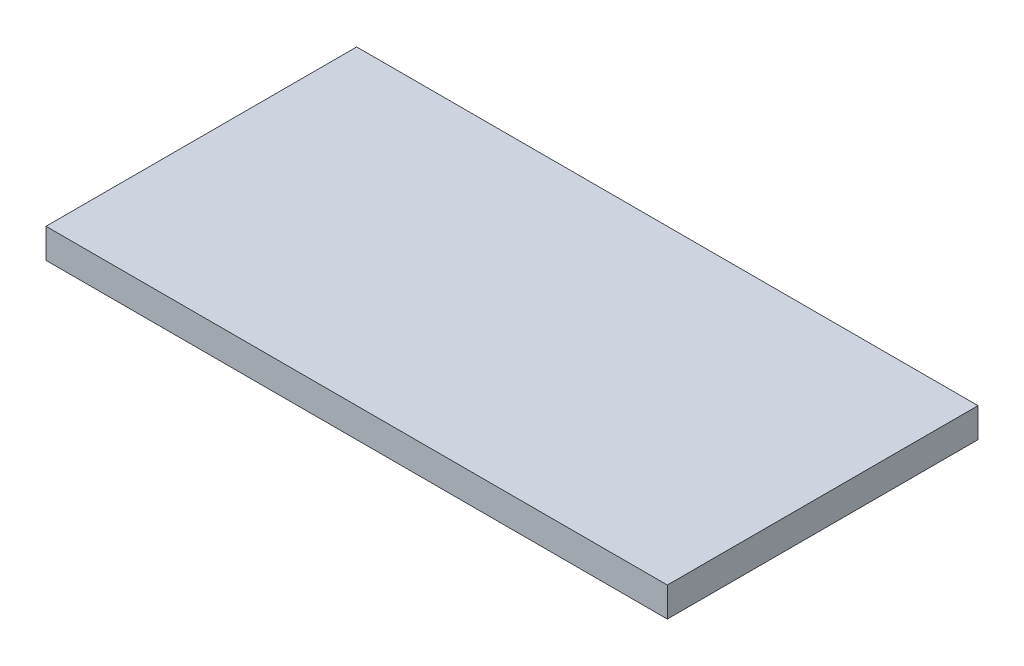
ISO-10303-21;
HEADER;
FILE_DESCRIPTION(('STEP AP214'),'2;1');
FILE_NAME('part.step','',(''),(''),'','','');
FILE_SCHEMA(('AUTOMOTIVE_DESIGN { 1 0 10303 214 1 1 1 1 }'));
ENDSEC;
DATA;
#1=APPLICATION_CONTEXT('core data for automotive mechanical design processes');
#2=APPLICATION_PROTOCOL_DEFINITION('international standard','automotive_design',2000,#1);
#3=PRODUCT_CONTEXT('',#1,'mechanical');
#4=PRODUCT('Part','Part','',(#3));
#5=PRODUCT_RELATED_PRODUCT_CATEGORY('part','',(#4));
#6=PRODUCT_DEFINITION_FORMATION('','',#4);
#7=PRODUCT_DEFINITION_CONTEXT('part definition',#1,'design');
#8=PRODUCT_DEFINITION('design','',#6,#7);
#9=PRODUCT_DEFINITION_SHAPE('','',#8);
#10=(LENGTH_UNIT() NAMED_UNIT(*) SI_UNIT(.MILLI.,.METRE.));
#11=(NAMED_UNIT(*) PLANE_ANGLE_UNIT() SI_UNIT($,.RADIAN.));
#12=(NAMED_UNIT(*) SI_UNIT($,.STERADIAN.) SOLID_ANGLE_UNIT());
#13=UNCERTAINTY_MEASURE_WITH_UNIT(LENGTH_MEASURE(1.E-05),#10,'distance_accuracy_value','');
#14=(GEOMETRIC_REPRESENTATION_CONTEXT(3) GLOBAL_UNCERTAINTY_ASSIGNED_CONTEXT((#13)) GLOBAL_UNIT_ASSIGNED_CONTEXT((#10,
#11,#12)) REPRESENTATION_CONTEXT('',''));
#15=CARTESIAN_POINT('',(0.,0.,0.));
#16=DIRECTION('',(0.,0.,1.));
#17=DIRECTION('',(1.,0.,0.));
#18=AXIS2_PLACEMENT_3D('',#15,#16,#17);
#19=CARTESIAN_POINT('',(200.,-19.,100.));
#20=DIRECTION('',(1.,0.,0.));
#21=DIRECTION('',(0.,0.,-1.));
#22=AXIS2_PLACEMENT_3D('',#19,#20,#21);
#23=PLANE('',#22);
#24=DIRECTION('',(0.,0.,-1.));
#25=VECTOR('',#24,1.);
#26=CARTESIAN_POINT('',(200.,0.,100.));
#27=LINE('',#26,#25);
#28=CARTESIAN_POINT('',(200.,0.,100.));
#29=VERTEX_POINT('',#28);
#30=CARTESIAN_POINT('',(200.,0.,-100.));
#31=VERTEX_POINT('',#30);
#32=EDGE_CURVE('E97',#29,#31,#27,.T.);
#33=ORIENTED_EDGE('',*,*,#32,.F.);
#34=DIRECTION('',(0.,1.,0.));
#35=VECTOR('',#34,1.);
#36=CARTESIAN_POINT('',(200.,-19.,100.));
#37=LINE('',#36,#35);
#38=CARTESIAN_POINT('',(200.,-19.,100.));
#39=VERTEX_POINT('',#38);
#40=EDGE_CURVE('E11',#39,#29,#37,.T.);
#41=ORIENTED_EDGE('',*,*,#40,.F.);
#42=DIRECTION('',(0.,0.,-1.));
#43=VECTOR('',#42,1.);
#44=CARTESIAN_POINT('',(200.,-19.,100.));
#45=LINE('',#44,#43);
#46=CARTESIAN_POINT('',(200.,-19.,-100.));
#47=VERTEX_POINT('',#46);
#48=EDGE_CURVE('E91',#39,#47,#45,.T.);
#49=ORIENTED_EDGE('',*,*,#48,.T.);
#50=DIRECTION('',(0.,1.,0.));
#51=VECTOR('',#50,1.);
#52=CARTESIAN_POINT('',(200.,-19.,-100.));
#53=LINE('',#52,#51);
#54=EDGE_CURVE('E36',#47,#31,#53,.T.);
#55=ORIENTED_EDGE('',*,*,#54,.T.);
#56=EDGE_LOOP('',(#33,#41,#49,#55));
#57=FACE_BOUND('',#56,.T.);
#58=ADVANCED_FACE('F33',(#57),#23,.T.);
#59=CARTESIAN_POINT('',(-200.,-19.,100.));
#60=DIRECTION('',(0.,0.,1.));
#61=DIRECTION('',(1.,0.,0.));
#62=AXIS2_PLACEMENT_3D('',#59,#60,#61);
#63=PLANE('',#62);
#64=DIRECTION('',(1.,0.,0.));
#65=VECTOR('',#64,1.);
#66=CARTESIAN_POINT('',(-200.,0.,100.));
#67=LINE('',#66,#65);
#68=CARTESIAN_POINT('',(-200.,0.,100.));
#69=VERTEX_POINT('',#68);
#70=EDGE_CURVE('E93',#69,#29,#67,.T.);
#71=ORIENTED_EDGE('',*,*,#70,.F.);
#72=DIRECTION('',(0.,1.,0.));
#73=VECTOR('',#72,1.);
#74=CARTESIAN_POINT('',(-200.,-19.,100.));
#75=LINE('',#74,#73);
#76=CARTESIAN_POINT('',(-200.,-19.,100.));
#77=VERTEX_POINT('',#76);
#78=EDGE_CURVE('E42',#77,#69,#75,.T.);
#79=ORIENTED_EDGE('',*,*,#78,.F.);
#80=DIRECTION('',(1.,0.,0.));
#81=VECTOR('',#80,1.);
#82=CARTESIAN_POINT('',(-200.,-19.,100.));
#83=LINE('',#82,#81);
#84=EDGE_CURVE('E88',#77,#39,#83,.T.);
#85=ORIENTED_EDGE('',*,*,#84,.T.);
#86=ORIENTED_EDGE('',*,*,#40,.T.);
#87=EDGE_LOOP('',(#71,#79,#85,#86));
#88=FACE_BOUND('',#87,.T.);
#89=ADVANCED_FACE('F107',(#88),#63,.T.);
#90=CARTESIAN_POINT('',(-200.,-19.,100.));
#91=DIRECTION('',(-1.,0.,0.));
#92=DIRECTION('',(0.,0.,1.));
#93=AXIS2_PLACEMENT_3D('',#90,#91,#92);
#94=PLANE('',#93);
#95=DIRECTION('',(0.,0.,1.));
#96=VECTOR('',#95,1.);
#97=CARTESIAN_POINT('',(-200.,0.,100.));
#98=LINE('',#97,#96);
#99=CARTESIAN_POINT('',(-200.,0.,-100.));
#100=VERTEX_POINT('',#99);
#101=EDGE_CURVE('E83',#100,#69,#98,.T.);
#102=ORIENTED_EDGE('',*,*,#101,.F.);
#103=DIRECTION('',(0.,1.,0.));
#104=VECTOR('',#103,1.);
#105=CARTESIAN_POINT('',(-200.,-19.,-100.));
#106=LINE('',#105,#104);
#107=CARTESIAN_POINT('',(-200.,-19.,-100.));
#108=VERTEX_POINT('',#107);
#109=EDGE_CURVE('E78',#108,#100,#106,.T.);
#110=ORIENTED_EDGE('',*,*,#109,.F.);
#111=DIRECTION('',(0.,0.,1.));
#112=VECTOR('',#111,1.);
#113=CARTESIAN_POINT('',(-200.,-19.,100.));
#114=LINE('',#113,#112);
#115=EDGE_CURVE('E81',#108,#77,#114,.T.);
#116=ORIENTED_EDGE('',*,*,#115,.T.);
#117=ORIENTED_EDGE('',*,*,#78,.T.);
#118=EDGE_LOOP('',(#102,#110,#116,#117));
#119=FACE_BOUND('',#118,.T.);
#120=ADVANCED_FACE('F80',(#119),#94,.T.);
#121=CARTESIAN_POINT('',(-200.,-19.,-100.));
#122=DIRECTION('',(0.,0.,-1.));
#123=DIRECTION('',(-1.,0.,0.));
#124=AXIS2_PLACEMENT_3D('',#121,#122,#123);
#125=PLANE('',#124);
#126=DIRECTION('',(-1.,0.,0.));
#127=VECTOR('',#126,1.);
#128=CARTESIAN_POINT('',(-200.,0.,-100.));
#129=LINE('',#128,#127);
#130=EDGE_CURVE('E100',#31,#100,#129,.T.);
#131=ORIENTED_EDGE('',*,*,#130,.F.);
#132=ORIENTED_EDGE('',*,*,#54,.F.);
#133=DIRECTION('',(-1.,0.,0.));
#134=VECTOR('',#133,1.);
#135=CARTESIAN_POINT('',(-200.,-19.,-100.));
#136=LINE('',#135,#134);
#137=EDGE_CURVE('E87',#47,#108,#136,.T.);
#138=ORIENTED_EDGE('',*,*,#137,.T.);
#139=ORIENTED_EDGE('',*,*,#109,.T.);
#140=EDGE_LOOP('',(#131,#132,#138,#139));
#141=FACE_BOUND('',#140,.T.);
#142=ADVANCED_FACE('F90',(#141),#125,.T.);
#143=CARTESIAN_POINT('',(0.,-19.,0.));
#144=DIRECTION('',(0.,-1.,0.));
#145=DIRECTION('',(0.,0.,-1.));
#146=AXIS2_PLACEMENT_3D('',#143,#144,#145);
#147=PLANE('',#146);
#148=ORIENTED_EDGE('',*,*,#48,.F.);
#149=ORIENTED_EDGE('',*,*,#84,.F.);
#150=ORIENTED_EDGE('',*,*,#115,.F.);
#151=ORIENTED_EDGE('',*,*,#137,.F.);
#152=EDGE_LOOP('',(#148,#149,#150,#151));
#153=FACE_BOUND('',#152,.T.);
#154=ADVANCED_FACE('F86',(#153),#147,.T.);
#155=CARTESIAN_POINT('',(0.,0.,0.));
#156=DIRECTION('',(0.,-1.,0.));
#157=DIRECTION('',(0.,0.,-1.));
#158=AXIS2_PLACEMENT_3D('',#155,#156,#157);
#159=PLANE('',#158);
#160=ORIENTED_EDGE('',*,*,#32,.T.);
#161=ORIENTED_EDGE('',*,*,#130,.T.);
#162=ORIENTED_EDGE('',*,*,#101,.T.);
#163=ORIENTED_EDGE('',*,*,#70,.T.);
#164=EDGE_LOOP('',(#160,#161,#162,#163));
#165=FACE_BOUND('',#164,.T.);
#166=ADVANCED_FACE('F106',(#165),#159,.F.);
#167=CLOSED_SHELL('',(#58,#89,#120,#142,#154,#166));
#168=MANIFOLD_SOLID_BREP('B2',#167);
#169=ADVANCED_BREP_SHAPE_REPRESENTATION('',(#18,#168),#14);
#170=SHAPE_DEFINITION_REPRESENTATION(#9,#169);
ENDSEC;
END-ISO-10303-21;
